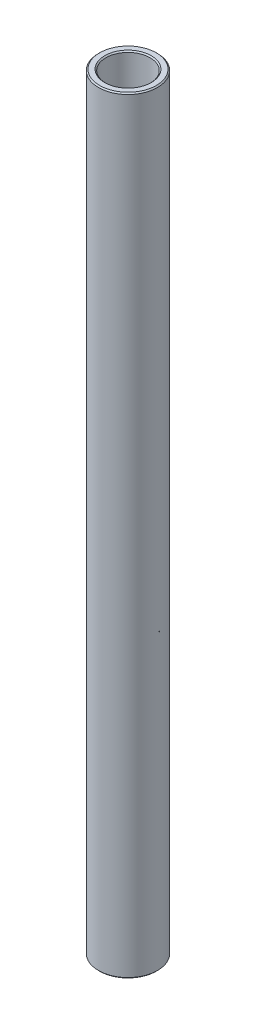
ISO-10303-21;
HEADER;
FILE_DESCRIPTION(('STEP AP214'),'2;1');
FILE_NAME('part.step','',(''),(''),'','','');
FILE_SCHEMA(('AUTOMOTIVE_DESIGN { 1 0 10303 214 1 1 1 1 }'));
ENDSEC;
DATA;
#1=APPLICATION_CONTEXT('core data for automotive mechanical design processes');
#2=APPLICATION_PROTOCOL_DEFINITION('international standard','automotive_design',2000,#1);
#3=PRODUCT_CONTEXT('',#1,'mechanical');
#4=PRODUCT('Part','Part','',(#3));
#5=PRODUCT_RELATED_PRODUCT_CATEGORY('part','',(#4));
#6=PRODUCT_DEFINITION_FORMATION('','',#4);
#7=PRODUCT_DEFINITION_CONTEXT('part definition',#1,'design');
#8=PRODUCT_DEFINITION('design','',#6,#7);
#9=PRODUCT_DEFINITION_SHAPE('','',#8);
#10=(LENGTH_UNIT() NAMED_UNIT(*) SI_UNIT(.MILLI.,.METRE.));
#11=(NAMED_UNIT(*) PLANE_ANGLE_UNIT() SI_UNIT($,.RADIAN.));
#12=(NAMED_UNIT(*) SI_UNIT($,.STERADIAN.) SOLID_ANGLE_UNIT());
#13=UNCERTAINTY_MEASURE_WITH_UNIT(LENGTH_MEASURE(1.E-05),#10,'distance_accuracy_value','');
#14=(GEOMETRIC_REPRESENTATION_CONTEXT(3) GLOBAL_UNCERTAINTY_ASSIGNED_CONTEXT((#13)) GLOBAL_UNIT_ASSIGNED_CONTEXT((#10,
#11,#12)) REPRESENTATION_CONTEXT('',''));
#15=CARTESIAN_POINT('',(0.,0.,0.));
#16=DIRECTION('',(0.,0.,1.));
#17=DIRECTION('',(1.,0.,0.));
#18=AXIS2_PLACEMENT_3D('',#15,#16,#17);
#19=CARTESIAN_POINT('',(0.,11.60859375,0.));
#20=DIRECTION('',(0.,1.,0.));
#21=DIRECTION('',(-1.,0.,0.));
#22=AXIS2_PLACEMENT_3D('',#19,#20,#21);
#23=CYLINDRICAL_SURFACE('',#22,4.76250000000001);
#24=CARTESIAN_POINT('',(0.,-82.296,0.));
#25=DIRECTION('',(0.,1.,0.));
#26=DIRECTION('',(-1.,0.,0.));
#27=AXIS2_PLACEMENT_3D('',#24,#25,#26);
#28=CIRCLE('',#27,4.76250000000001);
#29=CARTESIAN_POINT('',(-4.76250000000002,-82.296,0.));
#30=VERTEX_POINT('',#29);
#31=EDGE_CURVE('E51',#30,#30,#28,.F.);
#32=ORIENTED_EDGE('',*,*,#31,.T.);
#33=EDGE_LOOP('',(#32));
#34=FACE_BOUND('',#33,.T.);
#35=CARTESIAN_POINT('',(0.,82.296,0.));
#36=DIRECTION('',(0.,-1.,0.));
#37=DIRECTION('',(1.,0.,0.));
#38=AXIS2_PLACEMENT_3D('',#35,#36,#37);
#39=CIRCLE('',#38,4.76250000000001);
#40=CARTESIAN_POINT('',(4.76250000000002,82.296,0.));
#41=VERTEX_POINT('',#40);
#42=EDGE_CURVE('E54',#41,#41,#39,.F.);
#43=ORIENTED_EDGE('',*,*,#42,.T.);
#44=EDGE_LOOP('',(#43));
#45=FACE_BOUND('',#44,.T.);
#46=ADVANCED_FACE('F31',(#34,#45),#23,.F.);
#47=CARTESIAN_POINT('',(4.7625,82.55,0.));
#48=DIRECTION('',(0.,-1.,0.));
#49=DIRECTION('',(1.,0.,0.));
#50=AXIS2_PLACEMENT_3D('',#47,#48,#49);
#51=PLANE('',#50);
#52=CARTESIAN_POINT('',(0.,82.55,0.));
#53=DIRECTION('',(0.,-1.,0.));
#54=DIRECTION('',(1.,0.,0.));
#55=AXIS2_PLACEMENT_3D('',#52,#53,#54);
#56=CIRCLE('',#55,6.096);
#57=CARTESIAN_POINT('',(6.09600000000001,82.55,0.));
#58=VERTEX_POINT('',#57);
#59=EDGE_CURVE('E10',#58,#58,#56,.F.);
#60=ORIENTED_EDGE('',*,*,#59,.T.);
#61=EDGE_LOOP('',(#60));
#62=FACE_BOUND('',#61,.T.);
#63=CARTESIAN_POINT('',(0.,82.55,0.));
#64=DIRECTION('',(0.,-1.,0.));
#65=DIRECTION('',(1.,0.,0.));
#66=AXIS2_PLACEMENT_3D('',#63,#64,#65);
#67=CIRCLE('',#66,5.01650000000001);
#68=CARTESIAN_POINT('',(5.01650000000002,82.55,0.));
#69=VERTEX_POINT('',#68);
#70=EDGE_CURVE('E38',#69,#69,#67,.T.);
#71=ORIENTED_EDGE('',*,*,#70,.T.);
#72=EDGE_LOOP('',(#71));
#73=FACE_BOUND('',#72,.T.);
#74=ADVANCED_FACE('F77',(#62,#73),#51,.F.);
#75=CARTESIAN_POINT('',(0.,11.60859375,0.));
#76=DIRECTION('',(0.,1.,0.));
#77=DIRECTION('',(-1.,0.,0.));
#78=AXIS2_PLACEMENT_3D('',#75,#76,#77);
#79=CYLINDRICAL_SURFACE('',#78,6.35);
#80=CARTESIAN_POINT('',(0.,-82.296,0.));
#81=DIRECTION('',(0.,1.,0.));
#82=DIRECTION('',(-1.,0.,0.));
#83=AXIS2_PLACEMENT_3D('',#80,#81,#82);
#84=CIRCLE('',#83,6.35);
#85=CARTESIAN_POINT('',(-6.35000000000001,-82.296,0.));
#86=VERTEX_POINT('',#85);
#87=EDGE_CURVE('E42',#86,#86,#84,.T.);
#88=ORIENTED_EDGE('',*,*,#87,.T.);
#89=EDGE_LOOP('',(#88));
#90=FACE_BOUND('',#89,.T.);
#91=CARTESIAN_POINT('',(0.,82.296,0.));
#92=DIRECTION('',(0.,-1.,0.));
#93=DIRECTION('',(1.,0.,0.));
#94=AXIS2_PLACEMENT_3D('',#91,#92,#93);
#95=CIRCLE('',#94,6.35);
#96=CARTESIAN_POINT('',(6.35000000000001,82.296,0.));
#97=VERTEX_POINT('',#96);
#98=EDGE_CURVE('E46',#97,#97,#95,.T.);
#99=ORIENTED_EDGE('',*,*,#98,.T.);
#100=EDGE_LOOP('',(#99));
#101=FACE_BOUND('',#100,.T.);
#102=ADVANCED_FACE('F74',(#90,#101),#79,.T.);
#103=CARTESIAN_POINT('',(6.35000000000001,-82.55,0.));
#104=DIRECTION('',(0.,1.,0.));
#105=DIRECTION('',(-1.,0.,0.));
#106=AXIS2_PLACEMENT_3D('',#103,#104,#105);
#107=PLANE('',#106);
#108=CARTESIAN_POINT('',(0.,-82.55,0.));
#109=DIRECTION('',(0.,1.,0.));
#110=DIRECTION('',(-1.,0.,0.));
#111=AXIS2_PLACEMENT_3D('',#108,#109,#110);
#112=CIRCLE('',#111,5.01650000000002);
#113=CARTESIAN_POINT('',(-5.01650000000003,-82.55,0.));
#114=VERTEX_POINT('',#113);
#115=EDGE_CURVE('E57',#114,#114,#112,.T.);
#116=ORIENTED_EDGE('',*,*,#115,.T.);
#117=EDGE_LOOP('',(#116));
#118=FACE_BOUND('',#117,.T.);
#119=CARTESIAN_POINT('',(0.,-82.55,0.));
#120=DIRECTION('',(0.,1.,0.));
#121=DIRECTION('',(-1.,0.,0.));
#122=AXIS2_PLACEMENT_3D('',#119,#120,#121);
#123=CIRCLE('',#122,6.09600000000007);
#124=CARTESIAN_POINT('',(-6.09600000000008,-82.55,0.));
#125=VERTEX_POINT('',#124);
#126=EDGE_CURVE('E60',#125,#125,#123,.F.);
#127=ORIENTED_EDGE('',*,*,#126,.T.);
#128=EDGE_LOOP('',(#127));
#129=FACE_BOUND('',#128,.T.);
#130=ADVANCED_FACE('F64',(#118,#129),#107,.F.);
#131=CARTESIAN_POINT('',(0.,-82.55,0.));
#132=DIRECTION('',(0.,-1.,0.));
#133=DIRECTION('',(1.,0.,0.));
#134=AXIS2_PLACEMENT_3D('',#131,#132,#133);
#135=CONICAL_SURFACE('',#134,5.01650000000002,0.785398163397433);
#136=ORIENTED_EDGE('',*,*,#31,.F.);
#137=EDGE_LOOP('',(#136));
#138=FACE_BOUND('',#137,.T.);
#139=ORIENTED_EDGE('',*,*,#115,.F.);
#140=EDGE_LOOP('',(#139));
#141=FACE_BOUND('',#140,.T.);
#142=ADVANCED_FACE('F70',(#138,#141),#135,.F.);
#143=CARTESIAN_POINT('',(0.,-82.296,0.));
#144=DIRECTION('',(0.,1.,0.));
#145=DIRECTION('',(-1.,0.,0.));
#146=AXIS2_PLACEMENT_3D('',#143,#144,#145);
#147=CONICAL_SURFACE('',#146,6.35,0.785398163397433);
#148=ORIENTED_EDGE('',*,*,#126,.F.);
#149=EDGE_LOOP('',(#148));
#150=FACE_BOUND('',#149,.T.);
#151=ORIENTED_EDGE('',*,*,#87,.F.);
#152=EDGE_LOOP('',(#151));
#153=FACE_BOUND('',#152,.T.);
#154=ADVANCED_FACE('F66',(#150,#153),#147,.T.);
#155=CARTESIAN_POINT('',(0.,82.55,0.));
#156=DIRECTION('',(0.,-1.,0.));
#157=DIRECTION('',(1.,0.,0.));
#158=AXIS2_PLACEMENT_3D('',#155,#156,#157);
#159=CONICAL_SURFACE('',#158,6.096,0.78539816339746);
#160=ORIENTED_EDGE('',*,*,#98,.F.);
#161=EDGE_LOOP('',(#160));
#162=FACE_BOUND('',#161,.T.);
#163=ORIENTED_EDGE('',*,*,#59,.F.);
#164=EDGE_LOOP('',(#163));
#165=FACE_BOUND('',#164,.T.);
#166=ADVANCED_FACE('F69',(#162,#165),#159,.T.);
#167=CARTESIAN_POINT('',(0.,82.296,0.));
#168=DIRECTION('',(0.,1.,0.));
#169=DIRECTION('',(-1.,0.,0.));
#170=AXIS2_PLACEMENT_3D('',#167,#168,#169);
#171=CONICAL_SURFACE('',#170,4.76250000000001,0.785398163397433);
#172=ORIENTED_EDGE('',*,*,#70,.F.);
#173=EDGE_LOOP('',(#172));
#174=FACE_BOUND('',#173,.T.);
#175=ORIENTED_EDGE('',*,*,#42,.F.);
#176=EDGE_LOOP('',(#175));
#177=FACE_BOUND('',#176,.T.);
#178=ADVANCED_FACE('F33',(#174,#177),#171,.F.);
#179=CLOSED_SHELL('',(#46,#74,#102,#130,#142,#154,#166,#178));
#180=MANIFOLD_SOLID_BREP('B2',#179);
#181=ADVANCED_BREP_SHAPE_REPRESENTATION('',(#18,#180),#14);
#182=SHAPE_DEFINITION_REPRESENTATION(#9,#181);
ENDSEC;
END-ISO-10303-21;
